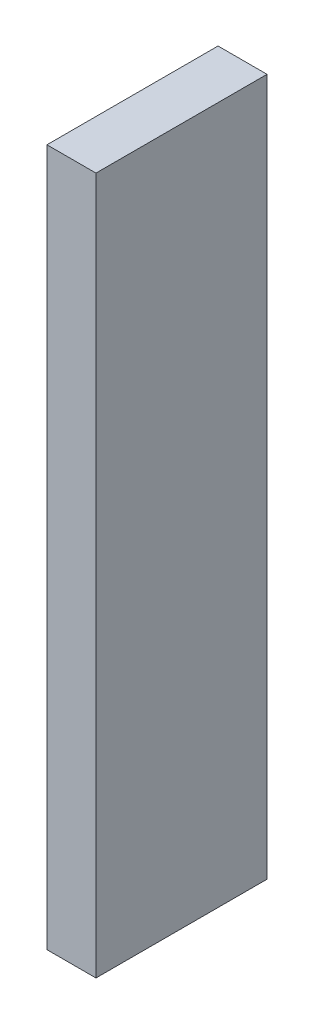
ISO-10303-21;
HEADER;
FILE_DESCRIPTION(('STEP AP214'),'2;1');
FILE_NAME('part.step','',(''),(''),'','','');
FILE_SCHEMA(('AUTOMOTIVE_DESIGN { 1 0 10303 214 1 1 1 1 }'));
ENDSEC;
DATA;
#1=APPLICATION_CONTEXT('core data for automotive mechanical design processes');
#2=APPLICATION_PROTOCOL_DEFINITION('international standard','automotive_design',2000,#1);
#3=PRODUCT_CONTEXT('',#1,'mechanical');
#4=PRODUCT('Part','Part','',(#3));
#5=PRODUCT_RELATED_PRODUCT_CATEGORY('part','',(#4));
#6=PRODUCT_DEFINITION_FORMATION('','',#4);
#7=PRODUCT_DEFINITION_CONTEXT('part definition',#1,'design');
#8=PRODUCT_DEFINITION('design','',#6,#7);
#9=PRODUCT_DEFINITION_SHAPE('','',#8);
#10=(LENGTH_UNIT() NAMED_UNIT(*) SI_UNIT(.MILLI.,.METRE.));
#11=(NAMED_UNIT(*) PLANE_ANGLE_UNIT() SI_UNIT($,.RADIAN.));
#12=(NAMED_UNIT(*) SI_UNIT($,.STERADIAN.) SOLID_ANGLE_UNIT());
#13=UNCERTAINTY_MEASURE_WITH_UNIT(LENGTH_MEASURE(1.E-05),#10,'distance_accuracy_value','');
#14=(GEOMETRIC_REPRESENTATION_CONTEXT(3) GLOBAL_UNCERTAINTY_ASSIGNED_CONTEXT((#13)) GLOBAL_UNIT_ASSIGNED_CONTEXT((#10,
#11,#12)) REPRESENTATION_CONTEXT('',''));
#15=CARTESIAN_POINT('',(0.,0.,0.));
#16=DIRECTION('',(0.,0.,1.));
#17=DIRECTION('',(1.,0.,0.));
#18=AXIS2_PLACEMENT_3D('',#15,#16,#17);
#19=CARTESIAN_POINT('',(0.,0.,15.707));
#20=DIRECTION('',(1.,0.,0.));
#21=DIRECTION('',(0.,0.,-1.));
#22=AXIS2_PLACEMENT_3D('',#19,#20,#21);
#23=PLANE('',#22);
#24=DIRECTION('',(0.,-1.,0.));
#25=VECTOR('',#24,1.);
#26=CARTESIAN_POINT('',(0.,0.,0.));
#27=LINE('',#26,#25);
#28=CARTESIAN_POINT('',(0.,64.,0.));
#29=VERTEX_POINT('',#28);
#30=CARTESIAN_POINT('',(0.,0.,0.));
#31=VERTEX_POINT('',#30);
#32=EDGE_CURVE('E107',#29,#31,#27,.T.);
#33=ORIENTED_EDGE('',*,*,#32,.T.);
#34=DIRECTION('',(0.,0.,-1.));
#35=VECTOR('',#34,1.);
#36=CARTESIAN_POINT('',(0.,0.,15.707));
#37=LINE('',#36,#35);
#38=CARTESIAN_POINT('',(0.,0.,15.707));
#39=VERTEX_POINT('',#38);
#40=EDGE_CURVE('E11',#39,#31,#37,.T.);
#41=ORIENTED_EDGE('',*,*,#40,.F.);
#42=DIRECTION('',(0.,-1.,0.));
#43=VECTOR('',#42,1.);
#44=CARTESIAN_POINT('',(0.,0.,15.707));
#45=LINE('',#44,#43);
#46=CARTESIAN_POINT('',(0.,64.,15.707));
#47=VERTEX_POINT('',#46);
#48=EDGE_CURVE('E91',#47,#39,#45,.T.);
#49=ORIENTED_EDGE('',*,*,#48,.F.);
#50=DIRECTION('',(0.,0.,-1.));
#51=VECTOR('',#50,1.);
#52=CARTESIAN_POINT('',(0.,64.,15.707));
#53=LINE('',#52,#51);
#54=EDGE_CURVE('E103',#47,#29,#53,.T.);
#55=ORIENTED_EDGE('',*,*,#54,.T.);
#56=EDGE_LOOP('',(#33,#41,#49,#55));
#57=FACE_BOUND('',#56,.T.);
#58=ADVANCED_FACE('F39',(#57),#23,.F.);
#59=CARTESIAN_POINT('',(0.,0.,15.707));
#60=DIRECTION('',(0.,1.,0.));
#61=DIRECTION('',(-1.,0.,0.));
#62=AXIS2_PLACEMENT_3D('',#59,#60,#61);
#63=PLANE('',#62);
#64=DIRECTION('',(1.,0.,0.));
#65=VECTOR('',#64,1.);
#66=CARTESIAN_POINT('',(0.,0.,0.));
#67=LINE('',#66,#65);
#68=CARTESIAN_POINT('',(4.5,0.,0.));
#69=VERTEX_POINT('',#68);
#70=EDGE_CURVE('E96',#31,#69,#67,.T.);
#71=ORIENTED_EDGE('',*,*,#70,.T.);
#72=DIRECTION('',(0.,0.,-1.));
#73=VECTOR('',#72,1.);
#74=CARTESIAN_POINT('',(4.5,0.,15.707));
#75=LINE('',#74,#73);
#76=CARTESIAN_POINT('',(4.5,0.,15.707));
#77=VERTEX_POINT('',#76);
#78=EDGE_CURVE('E48',#77,#69,#75,.T.);
#79=ORIENTED_EDGE('',*,*,#78,.F.);
#80=DIRECTION('',(1.,0.,0.));
#81=VECTOR('',#80,1.);
#82=CARTESIAN_POINT('',(0.,0.,15.707));
#83=LINE('',#82,#81);
#84=EDGE_CURVE('E86',#39,#77,#83,.T.);
#85=ORIENTED_EDGE('',*,*,#84,.F.);
#86=ORIENTED_EDGE('',*,*,#40,.T.);
#87=EDGE_LOOP('',(#71,#79,#85,#86));
#88=FACE_BOUND('',#87,.T.);
#89=ADVANCED_FACE('F95',(#88),#63,.F.);
#90=CARTESIAN_POINT('',(4.5,0.,15.707));
#91=DIRECTION('',(-1.,0.,0.));
#92=DIRECTION('',(0.,-1.,0.));
#93=AXIS2_PLACEMENT_3D('',#90,#91,#92);
#94=PLANE('',#93);
#95=DIRECTION('',(0.,1.,0.));
#96=VECTOR('',#95,1.);
#97=CARTESIAN_POINT('',(4.5,0.,0.));
#98=LINE('',#97,#96);
#99=CARTESIAN_POINT('',(4.49999999999998,64.,0.));
#100=VERTEX_POINT('',#99);
#101=EDGE_CURVE('E73',#69,#100,#98,.T.);
#102=ORIENTED_EDGE('',*,*,#101,.T.);
#103=DIRECTION('',(0.,0.,-1.));
#104=VECTOR('',#103,1.);
#105=CARTESIAN_POINT('',(4.49999999999998,64.,15.707));
#106=LINE('',#105,#104);
#107=CARTESIAN_POINT('',(4.49999999999998,64.,15.707));
#108=VERTEX_POINT('',#107);
#109=EDGE_CURVE('E98',#108,#100,#106,.T.);
#110=ORIENTED_EDGE('',*,*,#109,.F.);
#111=DIRECTION('',(0.,1.,0.));
#112=VECTOR('',#111,1.);
#113=CARTESIAN_POINT('',(4.5,0.,15.707));
#114=LINE('',#113,#112);
#115=EDGE_CURVE('E89',#77,#108,#114,.T.);
#116=ORIENTED_EDGE('',*,*,#115,.F.);
#117=ORIENTED_EDGE('',*,*,#78,.T.);
#118=EDGE_LOOP('',(#102,#110,#116,#117));
#119=FACE_BOUND('',#118,.T.);
#120=ADVANCED_FACE('F99',(#119),#94,.F.);
#121=CARTESIAN_POINT('',(0.,64.,15.707));
#122=DIRECTION('',(0.,-1.,0.));
#123=DIRECTION('',(0.,0.,-1.));
#124=AXIS2_PLACEMENT_3D('',#121,#122,#123);
#125=PLANE('',#124);
#126=DIRECTION('',(-1.,0.,0.));
#127=VECTOR('',#126,1.);
#128=CARTESIAN_POINT('',(0.,64.,0.));
#129=LINE('',#128,#127);
#130=EDGE_CURVE('E79',#100,#29,#129,.T.);
#131=ORIENTED_EDGE('',*,*,#130,.T.);
#132=ORIENTED_EDGE('',*,*,#54,.F.);
#133=DIRECTION('',(-1.,0.,0.));
#134=VECTOR('',#133,1.);
#135=CARTESIAN_POINT('',(0.,64.,15.707));
#136=LINE('',#135,#134);
#137=EDGE_CURVE('E56',#108,#47,#136,.T.);
#138=ORIENTED_EDGE('',*,*,#137,.F.);
#139=ORIENTED_EDGE('',*,*,#109,.T.);
#140=EDGE_LOOP('',(#131,#132,#138,#139));
#141=FACE_BOUND('',#140,.T.);
#142=ADVANCED_FACE('F120',(#141),#125,.F.);
#143=CARTESIAN_POINT('',(0.,0.,15.707));
#144=DIRECTION('',(0.,0.,-1.));
#145=DIRECTION('',(-1.,0.,0.));
#146=AXIS2_PLACEMENT_3D('',#143,#144,#145);
#147=PLANE('',#146);
#148=ORIENTED_EDGE('',*,*,#48,.T.);
#149=ORIENTED_EDGE('',*,*,#84,.T.);
#150=ORIENTED_EDGE('',*,*,#115,.T.);
#151=ORIENTED_EDGE('',*,*,#137,.T.);
#152=EDGE_LOOP('',(#148,#149,#150,#151));
#153=FACE_BOUND('',#152,.T.);
#154=ADVANCED_FACE('F87',(#153),#147,.F.);
#155=CARTESIAN_POINT('',(0.,0.,0.));
#156=DIRECTION('',(0.,0.,-1.));
#157=DIRECTION('',(-1.,0.,0.));
#158=AXIS2_PLACEMENT_3D('',#155,#156,#157);
#159=PLANE('',#158);
#160=ORIENTED_EDGE('',*,*,#32,.F.);
#161=ORIENTED_EDGE('',*,*,#130,.F.);
#162=ORIENTED_EDGE('',*,*,#101,.F.);
#163=ORIENTED_EDGE('',*,*,#70,.F.);
#164=EDGE_LOOP('',(#160,#161,#162,#163));
#165=FACE_BOUND('',#164,.T.);
#166=ADVANCED_FACE('F123',(#165),#159,.T.);
#167=CLOSED_SHELL('',(#58,#89,#120,#142,#154,#166));
#168=MANIFOLD_SOLID_BREP('B2',#167);
#169=ADVANCED_BREP_SHAPE_REPRESENTATION('',(#18,#168),#14);
#170=SHAPE_DEFINITION_REPRESENTATION(#9,#169);
ENDSEC;
END-ISO-10303-21;
